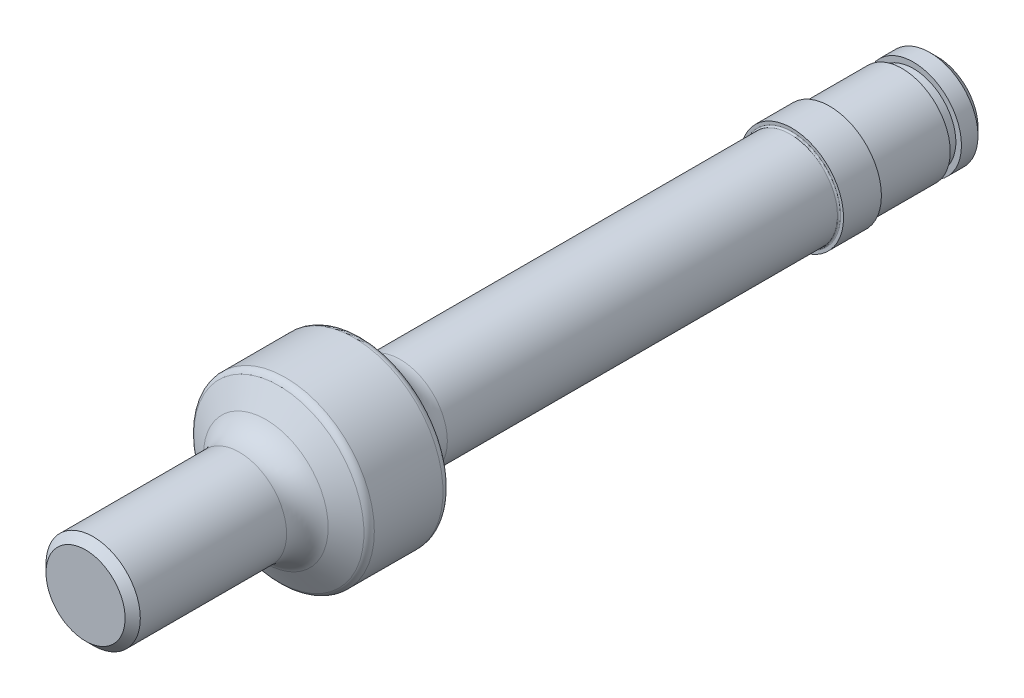
ISO-10303-21;
HEADER;
FILE_DESCRIPTION(('STEP AP214'),'2;1');
FILE_NAME('part.step','',(''),(''),'','','');
FILE_SCHEMA(('AUTOMOTIVE_DESIGN { 1 0 10303 214 1 1 1 1 }'));
ENDSEC;
DATA;
#1=APPLICATION_CONTEXT('core data for automotive mechanical design processes');
#2=APPLICATION_PROTOCOL_DEFINITION('international standard','automotive_design',2000,#1);
#3=PRODUCT_CONTEXT('',#1,'mechanical');
#4=PRODUCT('Part','Part','',(#3));
#5=PRODUCT_RELATED_PRODUCT_CATEGORY('part','',(#4));
#6=PRODUCT_DEFINITION_FORMATION('','',#4);
#7=PRODUCT_DEFINITION_CONTEXT('part definition',#1,'design');
#8=PRODUCT_DEFINITION('design','',#6,#7);
#9=PRODUCT_DEFINITION_SHAPE('','',#8);
#10=(LENGTH_UNIT() NAMED_UNIT(*) SI_UNIT(.MILLI.,.METRE.));
#11=(NAMED_UNIT(*) PLANE_ANGLE_UNIT() SI_UNIT($,.RADIAN.));
#12=(NAMED_UNIT(*) SI_UNIT($,.STERADIAN.) SOLID_ANGLE_UNIT());
#13=UNCERTAINTY_MEASURE_WITH_UNIT(LENGTH_MEASURE(1.E-05),#10,'distance_accuracy_value','');
#14=(GEOMETRIC_REPRESENTATION_CONTEXT(3) GLOBAL_UNCERTAINTY_ASSIGNED_CONTEXT((#13)) GLOBAL_UNIT_ASSIGNED_CONTEXT((#10,
#11,#12)) REPRESENTATION_CONTEXT('',''));
#15=CARTESIAN_POINT('',(0.,0.,0.));
#16=DIRECTION('',(0.,0.,1.));
#17=DIRECTION('',(1.,0.,0.));
#18=AXIS2_PLACEMENT_3D('',#15,#16,#17);
#19=CARTESIAN_POINT('',(0.,3.1623,-40.6019));
#20=DIRECTION('',(0.,0.,1.));
#21=DIRECTION('',(1.,0.,0.));
#22=AXIS2_PLACEMENT_3D('',#19,#20,#21);
#23=PLANE('',#22);
#24=CARTESIAN_POINT('',(0.,0.,-40.6019000000697));
#25=DIRECTION('',(0.,0.,1.));
#26=DIRECTION('',(1.,0.,0.));
#27=AXIS2_PLACEMENT_3D('',#24,#25,#26);
#28=CIRCLE('',#27,2.66229999999723);
#29=CARTESIAN_POINT('',(2.66229999999723,0.,-40.6019000000697));
#30=VERTEX_POINT('',#29);
#31=EDGE_CURVE('E257',#30,#30,#28,.T.);
#32=ORIENTED_EDGE('',*,*,#31,.F.);
#33=EDGE_LOOP('',(#32));
#34=FACE_BOUND('',#33,.T.);
#35=ADVANCED_FACE('F17',(#34),#23,.F.);
#36=CARTESIAN_POINT('',(0.,0.,-40.1019000000247));
#37=DIRECTION('',(0.,0.,1.));
#38=DIRECTION('',(1.,0.,0.));
#39=AXIS2_PLACEMENT_3D('',#36,#37,#38);
#40=CONICAL_SURFACE('',#39,3.16230000004225,0.785398163397448);
#41=ORIENTED_EDGE('',*,*,#31,.T.);
#42=EDGE_LOOP('',(#41));
#43=FACE_BOUND('',#42,.T.);
#44=CARTESIAN_POINT('',(0.,0.,-40.1019));
#45=DIRECTION('',(0.,0.,1.));
#46=DIRECTION('',(1.,0.,0.));
#47=AXIS2_PLACEMENT_3D('',#44,#45,#46);
#48=CIRCLE('',#47,3.1623);
#49=CARTESIAN_POINT('',(3.1623,0.,-40.1019));
#50=VERTEX_POINT('',#49);
#51=EDGE_CURVE('E256',#50,#50,#48,.T.);
#52=ORIENTED_EDGE('',*,*,#51,.F.);
#53=EDGE_LOOP('',(#52));
#54=FACE_BOUND('',#53,.T.);
#55=ADVANCED_FACE('F149',(#43,#54),#40,.T.);
#56=CARTESIAN_POINT('',(0.,0.,26.453846));
#57=DIRECTION('',(0.,0.,1.));
#58=DIRECTION('',(1.,0.,0.));
#59=AXIS2_PLACEMENT_3D('',#56,#57,#58);
#60=CYLINDRICAL_SURFACE('',#59,3.1623);
#61=ORIENTED_EDGE('',*,*,#51,.T.);
#62=EDGE_LOOP('',(#61));
#63=FACE_BOUND('',#62,.T.);
#64=CARTESIAN_POINT('',(0.,0.,-39.0144));
#65=DIRECTION('',(0.,0.,1.));
#66=DIRECTION('',(1.,0.,0.));
#67=AXIS2_PLACEMENT_3D('',#64,#65,#66);
#68=CIRCLE('',#67,3.1623);
#69=CARTESIAN_POINT('',(3.1623,0.,-39.0144));
#70=VERTEX_POINT('',#69);
#71=EDGE_CURVE('E253',#70,#70,#68,.F.);
#72=ORIENTED_EDGE('',*,*,#71,.T.);
#73=EDGE_LOOP('',(#72));
#74=FACE_BOUND('',#73,.T.);
#75=ADVANCED_FACE('F146',(#63,#74),#60,.T.);
#76=CARTESIAN_POINT('',(0.,3.10000000000002,15.3981));
#77=DIRECTION('',(0.,0.,-1.));
#78=DIRECTION('',(-1.,0.,0.));
#79=AXIS2_PLACEMENT_3D('',#76,#77,#78);
#80=PLANE('',#79);
#81=CARTESIAN_POINT('',(0.,0.,15.3980999999135));
#82=DIRECTION('',(0.,0.,-1.));
#83=DIRECTION('',(-1.,0.,0.));
#84=AXIS2_PLACEMENT_3D('',#81,#82,#83);
#85=CIRCLE('',#84,2.59999999997262);
#86=CARTESIAN_POINT('',(-2.59999999997262,0.,15.3980999999135));
#87=VERTEX_POINT('',#86);
#88=EDGE_CURVE('E250',#87,#87,#85,.T.);
#89=ORIENTED_EDGE('',*,*,#88,.F.);
#90=EDGE_LOOP('',(#89));
#91=FACE_BOUND('',#90,.T.);
#92=ADVANCED_FACE('F142',(#91),#80,.F.);
#93=CARTESIAN_POINT('',(0.,2.794,-39.0144));
#94=DIRECTION('',(0.,0.,-1.));
#95=DIRECTION('',(-1.,0.,0.));
#96=AXIS2_PLACEMENT_3D('',#93,#94,#95);
#97=PLANE('',#96);
#98=CARTESIAN_POINT('',(0.,0.,-39.0144));
#99=DIRECTION('',(0.,0.,-1.));
#100=DIRECTION('',(-1.,0.,0.));
#101=AXIS2_PLACEMENT_3D('',#98,#99,#100);
#102=CIRCLE('',#101,2.794);
#103=CARTESIAN_POINT('',(-2.794,0.,-39.0144));
#104=VERTEX_POINT('',#103);
#105=EDGE_CURVE('E247',#104,#104,#102,.F.);
#106=ORIENTED_EDGE('',*,*,#105,.F.);
#107=EDGE_LOOP('',(#106));
#108=FACE_BOUND('',#107,.T.);
#109=ORIENTED_EDGE('',*,*,#71,.F.);
#110=EDGE_LOOP('',(#109));
#111=FACE_BOUND('',#110,.T.);
#112=ADVANCED_FACE('F138',(#108,#111),#97,.F.);
#113=CARTESIAN_POINT('',(0.,0.,14.898100000039));
#114=DIRECTION('',(0.,0.,-1.));
#115=DIRECTION('',(-1.,0.,0.));
#116=AXIS2_PLACEMENT_3D('',#113,#114,#115);
#117=CONICAL_SURFACE('',#116,3.09999999984711,0.785398163397448);
#118=CARTESIAN_POINT('',(0.,0.,14.8981));
#119=DIRECTION('',(0.,0.,1.));
#120=DIRECTION('',(1.,0.,0.));
#121=AXIS2_PLACEMENT_3D('',#118,#119,#120);
#122=CIRCLE('',#121,3.10000000000001);
#123=CARTESIAN_POINT('',(3.10000000000001,0.,14.8981));
#124=VERTEX_POINT('',#123);
#125=EDGE_CURVE('E246',#124,#124,#122,.F.);
#126=ORIENTED_EDGE('',*,*,#125,.F.);
#127=EDGE_LOOP('',(#126));
#128=FACE_BOUND('',#127,.T.);
#129=ORIENTED_EDGE('',*,*,#88,.T.);
#130=EDGE_LOOP('',(#129));
#131=FACE_BOUND('',#130,.T.);
#132=ADVANCED_FACE('F134',(#128,#131),#117,.T.);
#133=CARTESIAN_POINT('',(0.,0.,-40.0654390361338));
#134=DIRECTION('',(0.,0.,-1.));
#135=DIRECTION('',(-1.,0.,0.));
#136=AXIS2_PLACEMENT_3D('',#133,#134,#135);
#137=CYLINDRICAL_SURFACE('',#136,2.794);
#138=ORIENTED_EDGE('',*,*,#105,.T.);
#139=EDGE_LOOP('',(#138));
#140=FACE_BOUND('',#139,.T.);
#141=CARTESIAN_POINT('',(0.,0.,-38.2778));
#142=DIRECTION('',(0.,0.,-1.));
#143=DIRECTION('',(-1.,0.,0.));
#144=AXIS2_PLACEMENT_3D('',#141,#142,#143);
#145=CIRCLE('',#144,2.794);
#146=CARTESIAN_POINT('',(-2.794,0.,-38.2778));
#147=VERTEX_POINT('',#146);
#148=EDGE_CURVE('E243',#147,#147,#145,.T.);
#149=ORIENTED_EDGE('',*,*,#148,.T.);
#150=EDGE_LOOP('',(#149));
#151=FACE_BOUND('',#150,.T.);
#152=ADVANCED_FACE('F130',(#140,#151),#137,.T.);
#153=CARTESIAN_POINT('',(0.,0.,26.453846));
#154=DIRECTION('',(0.,0.,1.));
#155=DIRECTION('',(1.,0.,0.));
#156=AXIS2_PLACEMENT_3D('',#153,#154,#155);
#157=CYLINDRICAL_SURFACE('',#156,3.10000000000001);
#158=CARTESIAN_POINT('',(0.,0.,5.28374149423676));
#159=DIRECTION('',(0.,0.,1.));
#160=DIRECTION('',(1.,0.,0.));
#161=AXIS2_PLACEMENT_3D('',#158,#159,#160);
#162=CIRCLE('',#161,3.10000000000001);
#163=CARTESIAN_POINT('',(3.10000000000001,0.,5.28374149423676));
#164=VERTEX_POINT('',#163);
#165=EDGE_CURVE('E115',#164,#164,#162,.T.);
#166=ORIENTED_EDGE('',*,*,#165,.T.);
#167=EDGE_LOOP('',(#166));
#168=FACE_BOUND('',#167,.T.);
#169=ORIENTED_EDGE('',*,*,#125,.T.);
#170=EDGE_LOOP('',(#169));
#171=FACE_BOUND('',#170,.T.);
#172=ADVANCED_FACE('F126',(#168,#171),#157,.T.);
#173=CARTESIAN_POINT('',(0.,2.794,-38.2778));
#174=DIRECTION('',(0.,0.,1.));
#175=DIRECTION('',(1.,0.,0.));
#176=AXIS2_PLACEMENT_3D('',#173,#174,#175);
#177=PLANE('',#176);
#178=CARTESIAN_POINT('',(0.,0.,-38.2778));
#179=DIRECTION('',(0.,0.,1.));
#180=DIRECTION('',(1.,0.,0.));
#181=AXIS2_PLACEMENT_3D('',#178,#179,#180);
#182=CIRCLE('',#181,3.1623);
#183=CARTESIAN_POINT('',(3.1623,0.,-38.2778));
#184=VERTEX_POINT('',#183);
#185=EDGE_CURVE('E110',#184,#184,#182,.T.);
#186=ORIENTED_EDGE('',*,*,#185,.F.);
#187=EDGE_LOOP('',(#186));
#188=FACE_BOUND('',#187,.T.);
#189=ORIENTED_EDGE('',*,*,#148,.F.);
#190=EDGE_LOOP('',(#189));
#191=FACE_BOUND('',#190,.T.);
#192=ADVANCED_FACE('F122',(#188,#191),#177,.F.);
#193=CARTESIAN_POINT('',(0.,0.,5.28374149423676));
#194=DIRECTION('',(0.,0.,1.));
#195=DIRECTION('',(1.,0.,0.));
#196=AXIS2_PLACEMENT_3D('',#193,#194,#195);
#197=TOROIDAL_SURFACE('',#196,5.10000000000001,2.);
#198=CARTESIAN_POINT('',(0.,0.,3.55169068666328));
#199=DIRECTION('',(0.,0.,-1.));
#200=DIRECTION('',(-1.,0.,0.));
#201=AXIS2_PLACEMENT_3D('',#198,#199,#200);
#202=CIRCLE('',#201,4.099999999994);
#203=CARTESIAN_POINT('',(-4.099999999994,0.,3.55169068666328));
#204=VERTEX_POINT('',#203);
#205=EDGE_CURVE('E102',#204,#204,#202,.T.);
#206=ORIENTED_EDGE('',*,*,#205,.F.);
#207=EDGE_LOOP('',(#206));
#208=FACE_BOUND('',#207,.T.);
#209=ORIENTED_EDGE('',*,*,#165,.F.);
#210=EDGE_LOOP('',(#209));
#211=FACE_BOUND('',#210,.T.);
#212=ADVANCED_FACE('F118',(#208,#211),#197,.F.);
#213=CARTESIAN_POINT('',(0.,0.,26.453846));
#214=DIRECTION('',(0.,0.,1.));
#215=DIRECTION('',(1.,0.,0.));
#216=AXIS2_PLACEMENT_3D('',#213,#214,#215);
#217=CYLINDRICAL_SURFACE('',#216,3.1623);
#218=CARTESIAN_POINT('',(0.,0.,-33.6153));
#219=DIRECTION('',(0.,0.,1.));
#220=DIRECTION('',(1.,0.,0.));
#221=AXIS2_PLACEMENT_3D('',#218,#219,#220);
#222=CIRCLE('',#221,3.1623);
#223=CARTESIAN_POINT('',(3.1623,0.,-33.6153));
#224=VERTEX_POINT('',#223);
#225=EDGE_CURVE('E91',#224,#224,#222,.F.);
#226=ORIENTED_EDGE('',*,*,#225,.T.);
#227=EDGE_LOOP('',(#226));
#228=FACE_BOUND('',#227,.T.);
#229=ORIENTED_EDGE('',*,*,#185,.T.);
#230=EDGE_LOOP('',(#229));
#231=FACE_BOUND('',#230,.T.);
#232=ADVANCED_FACE('F121',(#228,#231),#217,.T.);
#233=CARTESIAN_POINT('',(0.,0.,2.69028408507666));
#234=DIRECTION('',(0.,0.,-1.));
#235=DIRECTION('',(-1.,0.,0.));
#236=AXIS2_PLACEMENT_3D('',#233,#234,#235);
#237=CONICAL_SURFACE('',#236,5.59199999992188,1.04719755119794);
#238=CARTESIAN_POINT('',(0.,0.,2.69028408503697));
#239=DIRECTION('',(0.,0.,-1.));
#240=DIRECTION('',(-1.,0.,0.));
#241=AXIS2_PLACEMENT_3D('',#238,#239,#240);
#242=CIRCLE('',#241,5.59199999999999);
#243=CARTESIAN_POINT('',(-5.59199999999999,0.,2.69028408503697));
#244=VERTEX_POINT('',#243);
#245=EDGE_CURVE('E58',#244,#244,#242,.T.);
#246=ORIENTED_EDGE('',*,*,#245,.F.);
#247=EDGE_LOOP('',(#246));
#248=FACE_BOUND('',#247,.T.);
#249=ORIENTED_EDGE('',*,*,#205,.T.);
#250=EDGE_LOOP('',(#249));
#251=FACE_BOUND('',#250,.T.);
#252=ADVANCED_FACE('F96',(#248,#251),#237,.T.);
#253=CARTESIAN_POINT('',(0.,0.,-33.6153));
#254=DIRECTION('',(0.,0.,1.));
#255=DIRECTION('',(1.,0.,0.));
#256=AXIS2_PLACEMENT_3D('',#253,#254,#255);
#257=TOROIDAL_SURFACE('',#256,3.2623,0.1);
#258=CARTESIAN_POINT('',(0.,0.,-33.5153));
#259=DIRECTION('',(0.,0.,-1.));
#260=DIRECTION('',(-1.,0.,0.));
#261=AXIS2_PLACEMENT_3D('',#258,#259,#260);
#262=CIRCLE('',#261,3.2623);
#263=CARTESIAN_POINT('',(-3.2623,0.,-33.5153));
#264=VERTEX_POINT('',#263);
#265=CARTESIAN_POINT('',(3.2623,0.,-33.5153));
#266=VERTEX_POINT('',#265);
#267=EDGE_CURVE('E47',#264,#266,#262,.T.);
#268=ORIENTED_EDGE('',*,*,#267,.T.);
#269=CARTESIAN_POINT('',(0.,0.,-33.5153));
#270=DIRECTION('',(0.,0.,-1.));
#271=DIRECTION('',(1.,0.,0.));
#272=AXIS2_PLACEMENT_3D('',#269,#270,#271);
#273=CIRCLE('',#272,3.2623);
#274=EDGE_CURVE('E45',#266,#264,#273,.T.);
#275=ORIENTED_EDGE('',*,*,#274,.T.);
#276=EDGE_LOOP('',(#268,#275));
#277=FACE_BOUND('',#276,.T.);
#278=ORIENTED_EDGE('',*,*,#225,.F.);
#279=EDGE_LOOP('',(#278));
#280=FACE_BOUND('',#279,.T.);
#281=ADVANCED_FACE('F49',(#277,#280),#257,.F.);
#282=CARTESIAN_POINT('',(0.,0.,2.25727138314476));
#283=DIRECTION('',(0.,0.,-1.));
#284=DIRECTION('',(-1.,0.,0.));
#285=AXIS2_PLACEMENT_3D('',#282,#283,#284);
#286=TOROIDAL_SURFACE('',#285,5.34199999999999,0.5);
#287=CARTESIAN_POINT('',(0.,0.,2.25727138314476));
#288=DIRECTION('',(0.,0.,1.));
#289=DIRECTION('',(1.,0.,0.));
#290=AXIS2_PLACEMENT_3D('',#287,#288,#289);
#291=CIRCLE('',#290,5.842);
#292=CARTESIAN_POINT('',(5.842,0.,2.25727138314476));
#293=VERTEX_POINT('',#292);
#294=EDGE_CURVE('E53',#293,#293,#291,.F.);
#295=ORIENTED_EDGE('',*,*,#294,.F.);
#296=EDGE_LOOP('',(#295));
#297=FACE_BOUND('',#296,.T.);
#298=ORIENTED_EDGE('',*,*,#245,.T.);
#299=EDGE_LOOP('',(#298));
#300=FACE_BOUND('',#299,.T.);
#301=ADVANCED_FACE('F76',(#297,#300),#286,.T.);
#302=CARTESIAN_POINT('',(0.,3.4,-33.5153));
#303=DIRECTION('',(0.,0.,1.));
#304=DIRECTION('',(1.,0.,0.));
#305=AXIS2_PLACEMENT_3D('',#302,#303,#304);
#306=PLANE('',#305);
#307=CARTESIAN_POINT('',(0.,0.,-33.5153));
#308=DIRECTION('',(0.,0.,1.));
#309=DIRECTION('',(1.,0.,0.));
#310=AXIS2_PLACEMENT_3D('',#307,#308,#309);
#311=CIRCLE('',#310,3.4);
#312=CARTESIAN_POINT('',(3.4,0.,-33.5153));
#313=VERTEX_POINT('',#312);
#314=EDGE_CURVE('E229',#313,#313,#311,.T.);
#315=ORIENTED_EDGE('',*,*,#314,.F.);
#316=EDGE_LOOP('',(#315));
#317=FACE_BOUND('',#316,.T.);
#318=ORIENTED_EDGE('',*,*,#274,.F.);
#319=ORIENTED_EDGE('',*,*,#267,.F.);
#320=EDGE_LOOP('',(#318,#319));
#321=FACE_BOUND('',#320,.T.);
#322=ADVANCED_FACE('F57',(#317,#321),#306,.F.);
#323=CARTESIAN_POINT('',(0.,0.,26.453846));
#324=DIRECTION('',(0.,0.,1.));
#325=DIRECTION('',(1.,0.,0.));
#326=AXIS2_PLACEMENT_3D('',#323,#324,#325);
#327=CYLINDRICAL_SURFACE('',#326,5.842);
#328=CARTESIAN_POINT('',(0.,0.,-2.25727138314476));
#329=DIRECTION('',(0.,0.,-1.));
#330=DIRECTION('',(-1.,0.,0.));
#331=AXIS2_PLACEMENT_3D('',#328,#329,#330);
#332=CIRCLE('',#331,5.842);
#333=CARTESIAN_POINT('',(-5.842,0.,-2.25727138314476));
#334=VERTEX_POINT('',#333);
#335=EDGE_CURVE('E226',#334,#334,#332,.T.);
#336=ORIENTED_EDGE('',*,*,#335,.F.);
#337=EDGE_LOOP('',(#336));
#338=FACE_BOUND('',#337,.T.);
#339=ORIENTED_EDGE('',*,*,#294,.T.);
#340=EDGE_LOOP('',(#339));
#341=FACE_BOUND('',#340,.T.);
#342=ADVANCED_FACE('F75',(#338,#341),#327,.T.);
#343=CARTESIAN_POINT('',(0.,0.,26.453846));
#344=DIRECTION('',(0.,0.,1.));
#345=DIRECTION('',(1.,0.,0.));
#346=AXIS2_PLACEMENT_3D('',#343,#344,#345);
#347=CYLINDRICAL_SURFACE('',#346,3.4);
#348=CARTESIAN_POINT('',(0.,0.,-31.0261));
#349=DIRECTION('',(0.,0.,1.));
#350=DIRECTION('',(1.,0.,0.));
#351=AXIS2_PLACEMENT_3D('',#348,#349,#350);
#352=CIRCLE('',#351,3.4);
#353=CARTESIAN_POINT('',(3.4,0.,-31.0261));
#354=VERTEX_POINT('',#353);
#355=EDGE_CURVE('E228',#354,#354,#352,.F.);
#356=ORIENTED_EDGE('',*,*,#355,.T.);
#357=EDGE_LOOP('',(#356));
#358=FACE_BOUND('',#357,.T.);
#359=ORIENTED_EDGE('',*,*,#314,.T.);
#360=EDGE_LOOP('',(#359));
#361=FACE_BOUND('',#360,.T.);
#362=ADVANCED_FACE('F282',(#358,#361),#347,.T.);
#363=CARTESIAN_POINT('',(0.,0.,-2.25727138314476));
#364=DIRECTION('',(0.,0.,-1.));
#365=DIRECTION('',(-1.,0.,0.));
#366=AXIS2_PLACEMENT_3D('',#363,#364,#365);
#367=TOROIDAL_SURFACE('',#366,5.34199999999999,0.5);
#368=CARTESIAN_POINT('',(0.,0.,-2.69028408501981));
#369=DIRECTION('',(0.,0.,1.));
#370=DIRECTION('',(1.,0.,0.));
#371=AXIS2_PLACEMENT_3D('',#368,#369,#370);
#372=CIRCLE('',#371,5.59199999997873);
#373=CARTESIAN_POINT('',(5.59199999997872,0.,-2.69028408501981));
#374=VERTEX_POINT('',#373);
#375=EDGE_CURVE('E185',#374,#374,#372,.F.);
#376=ORIENTED_EDGE('',*,*,#375,.F.);
#377=EDGE_LOOP('',(#376));
#378=FACE_BOUND('',#377,.T.);
#379=ORIENTED_EDGE('',*,*,#335,.T.);
#380=EDGE_LOOP('',(#379));
#381=FACE_BOUND('',#380,.T.);
#382=ADVANCED_FACE('F203',(#378,#381),#367,.T.);
#383=CARTESIAN_POINT('',(0.,3.4,-31.0261));
#384=DIRECTION('',(0.,0.,-1.));
#385=DIRECTION('',(-1.,0.,0.));
#386=AXIS2_PLACEMENT_3D('',#383,#384,#385);
#387=PLANE('',#386);
#388=ORIENTED_EDGE('',*,*,#355,.F.);
#389=EDGE_LOOP('',(#388));
#390=FACE_BOUND('',#389,.T.);
#391=CARTESIAN_POINT('',(0.,0.,-31.0261));
#392=DIRECTION('',(0.,0.,1.));
#393=DIRECTION('',(-1.,0.,0.));
#394=AXIS2_PLACEMENT_3D('',#391,#392,#393);
#395=CIRCLE('',#394,3.19999999999995);
#396=CARTESIAN_POINT('',(3.19999999999995,0.,-31.0261));
#397=VERTEX_POINT('',#396);
#398=CARTESIAN_POINT('',(-3.19999999999995,0.,-31.0261));
#399=VERTEX_POINT('',#398);
#400=EDGE_CURVE('E182',#397,#399,#395,.F.);
#401=ORIENTED_EDGE('',*,*,#400,.T.);
#402=CARTESIAN_POINT('',(0.,0.,-31.0261));
#403=DIRECTION('',(0.,0.,1.));
#404=DIRECTION('',(1.,0.,0.));
#405=AXIS2_PLACEMENT_3D('',#402,#403,#404);
#406=CIRCLE('',#405,3.19999999999995);
#407=EDGE_CURVE('E36',#399,#397,#406,.F.);
#408=ORIENTED_EDGE('',*,*,#407,.T.);
#409=EDGE_LOOP('',(#401,#408));
#410=FACE_BOUND('',#409,.T.);
#411=ADVANCED_FACE('F193',(#390,#410),#387,.F.);
#412=CARTESIAN_POINT('',(0.,0.,-2.69028408507666));
#413=DIRECTION('',(0.,0.,1.));
#414=DIRECTION('',(1.,0.,0.));
#415=AXIS2_PLACEMENT_3D('',#412,#413,#414);
#416=CONICAL_SURFACE('',#415,5.59199999992188,1.04719755119794);
#417=ORIENTED_EDGE('',*,*,#375,.T.);
#418=EDGE_LOOP('',(#417));
#419=FACE_BOUND('',#418,.T.);
#420=CARTESIAN_POINT('',(0.,0.,-3.55169068666792));
#421=DIRECTION('',(0.,0.,1.));
#422=DIRECTION('',(1.,0.,0.));
#423=AXIS2_PLACEMENT_3D('',#420,#421,#422);
#424=CIRCLE('',#423,4.09999999999995);
#425=CARTESIAN_POINT('',(4.09999999999995,0.,-3.55169068666792));
#426=VERTEX_POINT('',#425);
#427=EDGE_CURVE('E180',#426,#426,#424,.T.);
#428=ORIENTED_EDGE('',*,*,#427,.T.);
#429=EDGE_LOOP('',(#428));
#430=FACE_BOUND('',#429,.T.);
#431=ADVANCED_FACE('F202',(#419,#430),#416,.T.);
#432=CARTESIAN_POINT('',(0.,0.,-30.9261));
#433=DIRECTION('',(0.,0.,-1.));
#434=DIRECTION('',(-1.,0.,0.));
#435=AXIS2_PLACEMENT_3D('',#432,#433,#434);
#436=TOROIDAL_SURFACE('',#435,3.19999999999995,0.1);
#437=CARTESIAN_POINT('',(0.,0.,-30.9261));
#438=DIRECTION('',(0.,0.,1.));
#439=DIRECTION('',(1.,0.,0.));
#440=AXIS2_PLACEMENT_3D('',#437,#438,#439);
#441=CIRCLE('',#440,3.09999999999995);
#442=CARTESIAN_POINT('',(3.09999999999995,0.,-30.9261));
#443=VERTEX_POINT('',#442);
#444=EDGE_CURVE('E28',#443,#443,#441,.T.);
#445=ORIENTED_EDGE('',*,*,#444,.F.);
#446=EDGE_LOOP('',(#445));
#447=FACE_BOUND('',#446,.T.);
#448=ORIENTED_EDGE('',*,*,#400,.F.);
#449=ORIENTED_EDGE('',*,*,#407,.F.);
#450=EDGE_LOOP('',(#448,#449));
#451=FACE_BOUND('',#450,.T.);
#452=ADVANCED_FACE('F168',(#447,#451),#436,.F.);
#453=CARTESIAN_POINT('',(0.,0.,-5.2837414942368));
#454=DIRECTION('',(0.,0.,1.));
#455=DIRECTION('',(1.,0.,0.));
#456=AXIS2_PLACEMENT_3D('',#453,#454,#455);
#457=TOROIDAL_SURFACE('',#456,5.09999999999995,2.);
#458=CARTESIAN_POINT('',(0.,0.,-5.2837414942368));
#459=DIRECTION('',(0.,0.,1.));
#460=DIRECTION('',(1.,0.,0.));
#461=AXIS2_PLACEMENT_3D('',#458,#459,#460);
#462=CIRCLE('',#461,3.09999999999995);
#463=CARTESIAN_POINT('',(3.09999999999995,0.,-5.2837414942368));
#464=VERTEX_POINT('',#463);
#465=EDGE_CURVE('E11',#464,#464,#462,.F.);
#466=ORIENTED_EDGE('',*,*,#465,.F.);
#467=EDGE_LOOP('',(#466));
#468=FACE_BOUND('',#467,.T.);
#469=ORIENTED_EDGE('',*,*,#427,.F.);
#470=EDGE_LOOP('',(#469));
#471=FACE_BOUND('',#470,.T.);
#472=ADVANCED_FACE('F162',(#468,#471),#457,.F.);
#473=CARTESIAN_POINT('',(0.,0.,26.453846));
#474=DIRECTION('',(0.,0.,1.));
#475=DIRECTION('',(1.,0.,0.));
#476=AXIS2_PLACEMENT_3D('',#473,#474,#475);
#477=CYLINDRICAL_SURFACE('',#476,3.09999999999995);
#478=ORIENTED_EDGE('',*,*,#444,.T.);
#479=EDGE_LOOP('',(#478));
#480=FACE_BOUND('',#479,.T.);
#481=ORIENTED_EDGE('',*,*,#465,.T.);
#482=EDGE_LOOP('',(#481));
#483=FACE_BOUND('',#482,.T.);
#484=ADVANCED_FACE('F160',(#480,#483),#477,.T.);
#485=CLOSED_SHELL('',(#35,#55,#75,#92,#112,#132,#152,#172,#192,#212,#232,#252,#281,#301,#322,
#342,#362,#382,#411,#431,#452,#472,#484));
#486=MANIFOLD_SOLID_BREP('B1',#485);
#487=ADVANCED_BREP_SHAPE_REPRESENTATION('',(#18,#486),#14);
#488=SHAPE_DEFINITION_REPRESENTATION(#9,#487);
ENDSEC;
END-ISO-10303-21;
